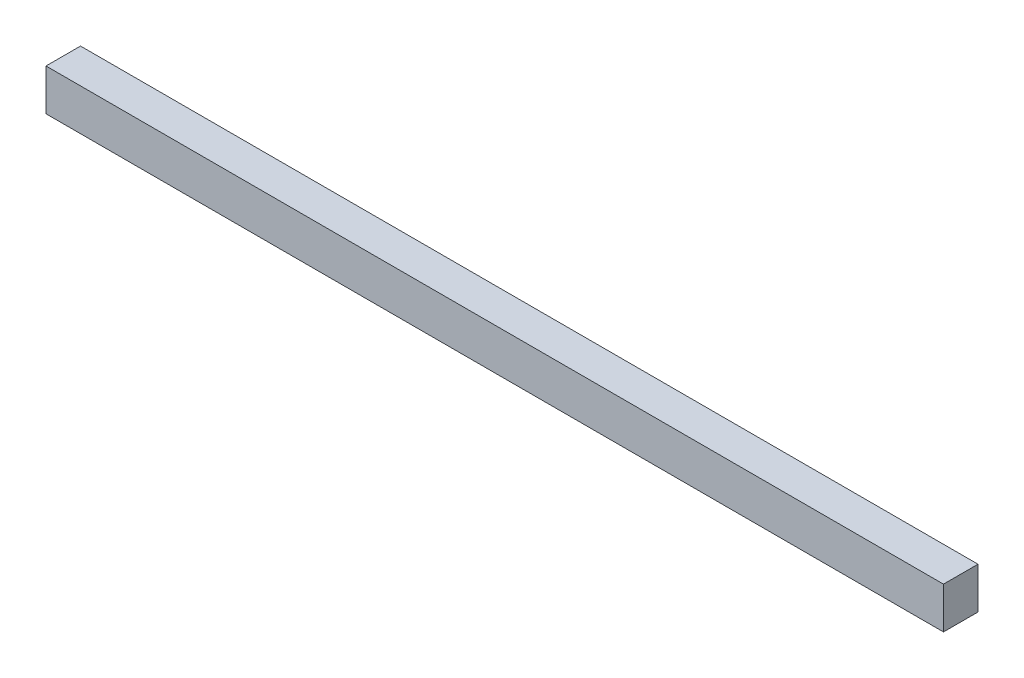
ISO-10303-21;
HEADER;
FILE_DESCRIPTION(('STEP AP214'),'2;1');
FILE_NAME('part.step','',(''),(''),'','','');
FILE_SCHEMA(('AUTOMOTIVE_DESIGN { 1 0 10303 214 1 1 1 1 }'));
ENDSEC;
DATA;
#1=APPLICATION_CONTEXT('core data for automotive mechanical design processes');
#2=APPLICATION_PROTOCOL_DEFINITION('international standard','automotive_design',2000,#1);
#3=PRODUCT_CONTEXT('',#1,'mechanical');
#4=PRODUCT('Part','Part','',(#3));
#5=PRODUCT_RELATED_PRODUCT_CATEGORY('part','',(#4));
#6=PRODUCT_DEFINITION_FORMATION('','',#4);
#7=PRODUCT_DEFINITION_CONTEXT('part definition',#1,'design');
#8=PRODUCT_DEFINITION('design','',#6,#7);
#9=PRODUCT_DEFINITION_SHAPE('','',#8);
#10=(LENGTH_UNIT() NAMED_UNIT(*) SI_UNIT(.MILLI.,.METRE.));
#11=(NAMED_UNIT(*) PLANE_ANGLE_UNIT() SI_UNIT($,.RADIAN.));
#12=(NAMED_UNIT(*) SI_UNIT($,.STERADIAN.) SOLID_ANGLE_UNIT());
#13=UNCERTAINTY_MEASURE_WITH_UNIT(LENGTH_MEASURE(1.E-05),#10,'distance_accuracy_value','');
#14=(GEOMETRIC_REPRESENTATION_CONTEXT(3) GLOBAL_UNCERTAINTY_ASSIGNED_CONTEXT((#13)) GLOBAL_UNIT_ASSIGNED_CONTEXT((#10,
#11,#12)) REPRESENTATION_CONTEXT('',''));
#15=CARTESIAN_POINT('',(0.,0.,0.));
#16=DIRECTION('',(0.,0.,1.));
#17=DIRECTION('',(1.,0.,0.));
#18=AXIS2_PLACEMENT_3D('',#15,#16,#17);
#19=CARTESIAN_POINT('',(0.,0.,1.27));
#20=DIRECTION('',(1.,0.,0.));
#21=DIRECTION('',(0.,0.,-1.));
#22=AXIS2_PLACEMENT_3D('',#19,#20,#21);
#23=PLANE('',#22);
#24=DIRECTION('',(0.,-1.,0.));
#25=VECTOR('',#24,1.);
#26=CARTESIAN_POINT('',(0.,0.,0.));
#27=LINE('',#26,#25);
#28=CARTESIAN_POINT('',(0.,1.524,0.));
#29=VERTEX_POINT('',#28);
#30=CARTESIAN_POINT('',(0.,0.,0.));
#31=VERTEX_POINT('',#30);
#32=EDGE_CURVE('E107',#29,#31,#27,.T.);
#33=ORIENTED_EDGE('',*,*,#32,.T.);
#34=DIRECTION('',(0.,0.,-1.));
#35=VECTOR('',#34,1.);
#36=CARTESIAN_POINT('',(0.,0.,1.27));
#37=LINE('',#36,#35);
#38=CARTESIAN_POINT('',(0.,0.,1.27));
#39=VERTEX_POINT('',#38);
#40=EDGE_CURVE('E11',#39,#31,#37,.T.);
#41=ORIENTED_EDGE('',*,*,#40,.F.);
#42=DIRECTION('',(0.,-1.,0.));
#43=VECTOR('',#42,1.);
#44=CARTESIAN_POINT('',(0.,0.,1.27));
#45=LINE('',#44,#43);
#46=CARTESIAN_POINT('',(0.,1.524,1.27));
#47=VERTEX_POINT('',#46);
#48=EDGE_CURVE('E91',#47,#39,#45,.T.);
#49=ORIENTED_EDGE('',*,*,#48,.F.);
#50=DIRECTION('',(0.,0.,-1.));
#51=VECTOR('',#50,1.);
#52=CARTESIAN_POINT('',(0.,1.524,1.27));
#53=LINE('',#52,#51);
#54=EDGE_CURVE('E103',#47,#29,#53,.T.);
#55=ORIENTED_EDGE('',*,*,#54,.T.);
#56=EDGE_LOOP('',(#33,#41,#49,#55));
#57=FACE_BOUND('',#56,.T.);
#58=ADVANCED_FACE('F39',(#57),#23,.F.);
#59=CARTESIAN_POINT('',(0.,0.,1.27));
#60=DIRECTION('',(0.,1.,0.));
#61=DIRECTION('',(0.,0.,1.));
#62=AXIS2_PLACEMENT_3D('',#59,#60,#61);
#63=PLANE('',#62);
#64=DIRECTION('',(1.,0.,0.));
#65=VECTOR('',#64,1.);
#66=CARTESIAN_POINT('',(0.,0.,0.));
#67=LINE('',#66,#65);
#68=CARTESIAN_POINT('',(33.02,0.,0.));
#69=VERTEX_POINT('',#68);
#70=EDGE_CURVE('E96',#31,#69,#67,.T.);
#71=ORIENTED_EDGE('',*,*,#70,.T.);
#72=DIRECTION('',(0.,0.,-1.));
#73=VECTOR('',#72,1.);
#74=CARTESIAN_POINT('',(33.02,0.,1.27));
#75=LINE('',#74,#73);
#76=CARTESIAN_POINT('',(33.02,0.,1.27));
#77=VERTEX_POINT('',#76);
#78=EDGE_CURVE('E48',#77,#69,#75,.T.);
#79=ORIENTED_EDGE('',*,*,#78,.F.);
#80=DIRECTION('',(1.,0.,0.));
#81=VECTOR('',#80,1.);
#82=CARTESIAN_POINT('',(0.,0.,1.27));
#83=LINE('',#82,#81);
#84=EDGE_CURVE('E86',#39,#77,#83,.T.);
#85=ORIENTED_EDGE('',*,*,#84,.F.);
#86=ORIENTED_EDGE('',*,*,#40,.T.);
#87=EDGE_LOOP('',(#71,#79,#85,#86));
#88=FACE_BOUND('',#87,.T.);
#89=ADVANCED_FACE('F95',(#88),#63,.F.);
#90=CARTESIAN_POINT('',(33.02,0.,1.27));
#91=DIRECTION('',(-1.,0.,0.));
#92=DIRECTION('',(0.,0.,1.));
#93=AXIS2_PLACEMENT_3D('',#90,#91,#92);
#94=PLANE('',#93);
#95=DIRECTION('',(0.,1.,0.));
#96=VECTOR('',#95,1.);
#97=CARTESIAN_POINT('',(33.02,0.,0.));
#98=LINE('',#97,#96);
#99=CARTESIAN_POINT('',(33.02,1.524,0.));
#100=VERTEX_POINT('',#99);
#101=EDGE_CURVE('E73',#69,#100,#98,.T.);
#102=ORIENTED_EDGE('',*,*,#101,.T.);
#103=DIRECTION('',(0.,0.,-1.));
#104=VECTOR('',#103,1.);
#105=CARTESIAN_POINT('',(33.02,1.524,1.27));
#106=LINE('',#105,#104);
#107=CARTESIAN_POINT('',(33.02,1.524,1.27));
#108=VERTEX_POINT('',#107);
#109=EDGE_CURVE('E98',#108,#100,#106,.T.);
#110=ORIENTED_EDGE('',*,*,#109,.F.);
#111=DIRECTION('',(0.,1.,0.));
#112=VECTOR('',#111,1.);
#113=CARTESIAN_POINT('',(33.02,0.,1.27));
#114=LINE('',#113,#112);
#115=EDGE_CURVE('E89',#77,#108,#114,.T.);
#116=ORIENTED_EDGE('',*,*,#115,.F.);
#117=ORIENTED_EDGE('',*,*,#78,.T.);
#118=EDGE_LOOP('',(#102,#110,#116,#117));
#119=FACE_BOUND('',#118,.T.);
#120=ADVANCED_FACE('F99',(#119),#94,.F.);
#121=CARTESIAN_POINT('',(0.,1.524,1.27));
#122=DIRECTION('',(0.,-1.,0.));
#123=DIRECTION('',(1.,0.,0.));
#124=AXIS2_PLACEMENT_3D('',#121,#122,#123);
#125=PLANE('',#124);
#126=DIRECTION('',(-1.,0.,0.));
#127=VECTOR('',#126,1.);
#128=CARTESIAN_POINT('',(0.,1.524,0.));
#129=LINE('',#128,#127);
#130=EDGE_CURVE('E79',#100,#29,#129,.T.);
#131=ORIENTED_EDGE('',*,*,#130,.T.);
#132=ORIENTED_EDGE('',*,*,#54,.F.);
#133=DIRECTION('',(-1.,0.,0.));
#134=VECTOR('',#133,1.);
#135=CARTESIAN_POINT('',(0.,1.524,1.27));
#136=LINE('',#135,#134);
#137=EDGE_CURVE('E56',#108,#47,#136,.T.);
#138=ORIENTED_EDGE('',*,*,#137,.F.);
#139=ORIENTED_EDGE('',*,*,#109,.T.);
#140=EDGE_LOOP('',(#131,#132,#138,#139));
#141=FACE_BOUND('',#140,.T.);
#142=ADVANCED_FACE('F120',(#141),#125,.F.);
#143=CARTESIAN_POINT('',(0.,0.,1.27));
#144=DIRECTION('',(0.,0.,-1.));
#145=DIRECTION('',(-1.,0.,0.));
#146=AXIS2_PLACEMENT_3D('',#143,#144,#145);
#147=PLANE('',#146);
#148=ORIENTED_EDGE('',*,*,#48,.T.);
#149=ORIENTED_EDGE('',*,*,#84,.T.);
#150=ORIENTED_EDGE('',*,*,#115,.T.);
#151=ORIENTED_EDGE('',*,*,#137,.T.);
#152=EDGE_LOOP('',(#148,#149,#150,#151));
#153=FACE_BOUND('',#152,.T.);
#154=ADVANCED_FACE('F87',(#153),#147,.F.);
#155=CARTESIAN_POINT('',(0.,0.,0.));
#156=DIRECTION('',(0.,0.,-1.));
#157=DIRECTION('',(-1.,0.,0.));
#158=AXIS2_PLACEMENT_3D('',#155,#156,#157);
#159=PLANE('',#158);
#160=ORIENTED_EDGE('',*,*,#32,.F.);
#161=ORIENTED_EDGE('',*,*,#130,.F.);
#162=ORIENTED_EDGE('',*,*,#101,.F.);
#163=ORIENTED_EDGE('',*,*,#70,.F.);
#164=EDGE_LOOP('',(#160,#161,#162,#163));
#165=FACE_BOUND('',#164,.T.);
#166=ADVANCED_FACE('F123',(#165),#159,.T.);
#167=CLOSED_SHELL('',(#58,#89,#120,#142,#154,#166));
#168=MANIFOLD_SOLID_BREP('B2',#167);
#169=ADVANCED_BREP_SHAPE_REPRESENTATION('',(#18,#168),#14);
#170=SHAPE_DEFINITION_REPRESENTATION(#9,#169);
ENDSEC;
END-ISO-10303-21;
